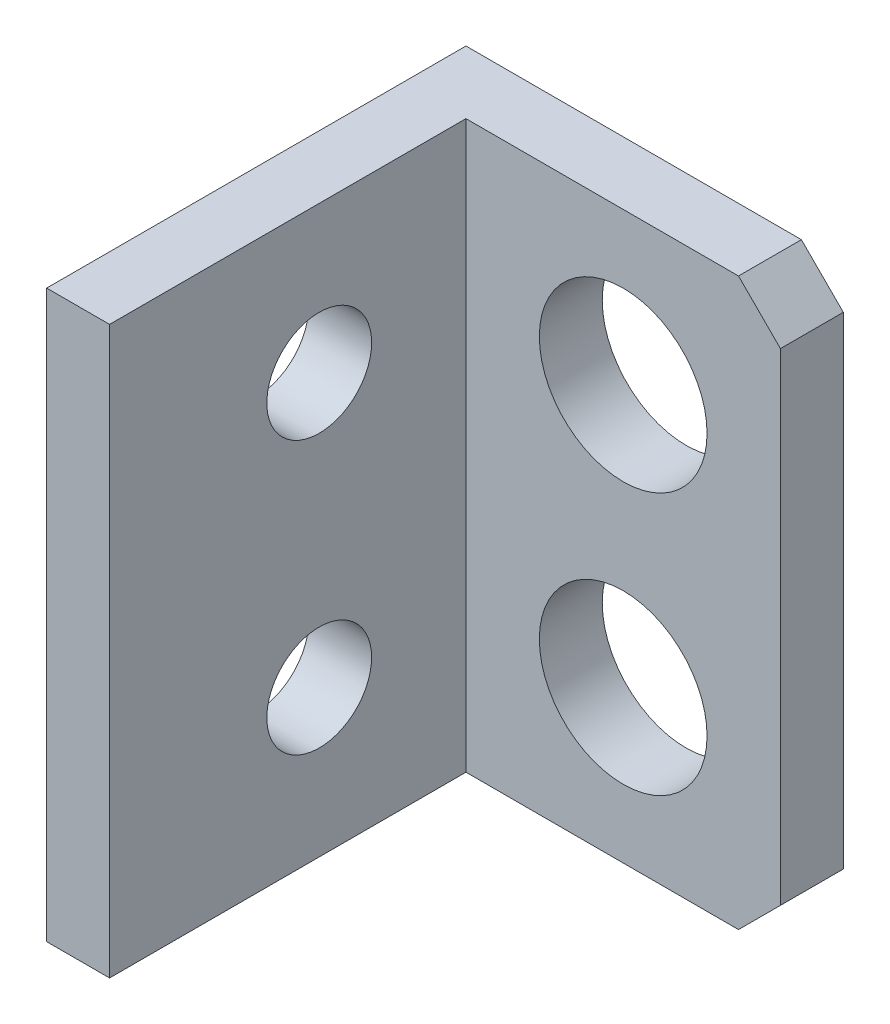
ISO-10303-21;
HEADER;
FILE_DESCRIPTION(('STEP AP214'),'2;1');
FILE_NAME('part.step','',(''),(''),'','','');
FILE_SCHEMA(('AUTOMOTIVE_DESIGN { 1 0 10303 214 1 1 1 1 }'));
ENDSEC;
DATA;
#1=APPLICATION_CONTEXT('core data for automotive mechanical design processes');
#2=APPLICATION_PROTOCOL_DEFINITION('international standard','automotive_design',2000,#1);
#3=PRODUCT_CONTEXT('',#1,'mechanical');
#4=PRODUCT('Part','Part','',(#3));
#5=PRODUCT_RELATED_PRODUCT_CATEGORY('part','',(#4));
#6=PRODUCT_DEFINITION_FORMATION('','',#4);
#7=PRODUCT_DEFINITION_CONTEXT('part definition',#1,'design');
#8=PRODUCT_DEFINITION('design','',#6,#7);
#9=PRODUCT_DEFINITION_SHAPE('','',#8);
#10=(LENGTH_UNIT() NAMED_UNIT(*) SI_UNIT(.MILLI.,.METRE.));
#11=(NAMED_UNIT(*) PLANE_ANGLE_UNIT() SI_UNIT($,.RADIAN.));
#12=(NAMED_UNIT(*) SI_UNIT($,.STERADIAN.) SOLID_ANGLE_UNIT());
#13=UNCERTAINTY_MEASURE_WITH_UNIT(LENGTH_MEASURE(1.E-05),#10,'distance_accuracy_value','');
#14=(GEOMETRIC_REPRESENTATION_CONTEXT(3) GLOBAL_UNCERTAINTY_ASSIGNED_CONTEXT((#13)) GLOBAL_UNIT_ASSIGNED_CONTEXT((#10,
#11,#12)) REPRESENTATION_CONTEXT('',''));
#15=CARTESIAN_POINT('',(0.,0.,0.));
#16=DIRECTION('',(0.,0.,1.));
#17=DIRECTION('',(1.,0.,0.));
#18=AXIS2_PLACEMENT_3D('',#15,#16,#17);
#19=CARTESIAN_POINT('',(3.,0.,0.));
#20=DIRECTION('',(-1.,0.,0.));
#21=DIRECTION('',(0.,0.,1.));
#22=AXIS2_PLACEMENT_3D('',#19,#20,#21);
#23=PLANE('',#22);
#24=CARTESIAN_POINT('',(3.,20.,-10.));
#25=DIRECTION('',(1.,0.,0.));
#26=DIRECTION('',(0.,0.,-1.));
#27=AXIS2_PLACEMENT_3D('',#24,#25,#26);
#28=CIRCLE('',#27,2.5);
#29=CARTESIAN_POINT('',(3.,20.,-12.5));
#30=VERTEX_POINT('',#29);
#31=EDGE_CURVE('E141',#30,#30,#28,.T.);
#32=ORIENTED_EDGE('',*,*,#31,.F.);
#33=EDGE_LOOP('',(#32));
#34=FACE_BOUND('',#33,.T.);
#35=CARTESIAN_POINT('',(3.,7.,-10.));
#36=DIRECTION('',(1.,0.,0.));
#37=DIRECTION('',(0.,0.,-1.));
#38=AXIS2_PLACEMENT_3D('',#35,#36,#37);
#39=CIRCLE('',#38,2.5);
#40=CARTESIAN_POINT('',(3.,7.,-12.5));
#41=VERTEX_POINT('',#40);
#42=EDGE_CURVE('E149',#41,#41,#39,.T.);
#43=ORIENTED_EDGE('',*,*,#42,.F.);
#44=EDGE_LOOP('',(#43));
#45=FACE_BOUND('',#44,.T.);
#46=DIRECTION('',(0.,-1.,0.));
#47=VECTOR('',#46,1.);
#48=CARTESIAN_POINT('',(3.,27.,-17.));
#49=LINE('',#48,#47);
#50=CARTESIAN_POINT('',(3.,27.,-17.));
#51=VERTEX_POINT('',#50);
#52=CARTESIAN_POINT('',(3.,0.,-17.));
#53=VERTEX_POINT('',#52);
#54=EDGE_CURVE('E116',#51,#53,#49,.T.);
#55=ORIENTED_EDGE('',*,*,#54,.F.);
#56=DIRECTION('',(0.,0.,1.));
#57=VECTOR('',#56,1.);
#58=CARTESIAN_POINT('',(3.,27.,0.));
#59=LINE('',#58,#57);
#60=CARTESIAN_POINT('',(3.,27.,0.));
#61=VERTEX_POINT('',#60);
#62=EDGE_CURVE('E122',#51,#61,#59,.T.);
#63=ORIENTED_EDGE('',*,*,#62,.T.);
#64=DIRECTION('',(0.,-1.,0.));
#65=VECTOR('',#64,1.);
#66=CARTESIAN_POINT('',(3.,0.,0.));
#67=LINE('',#66,#65);
#68=CARTESIAN_POINT('',(3.,0.,0.));
#69=VERTEX_POINT('',#68);
#70=EDGE_CURVE('E119',#61,#69,#67,.T.);
#71=ORIENTED_EDGE('',*,*,#70,.T.);
#72=DIRECTION('',(0.,0.,-1.));
#73=VECTOR('',#72,1.);
#74=CARTESIAN_POINT('',(3.,0.,0.));
#75=LINE('',#74,#73);
#76=EDGE_CURVE('E106',#69,#53,#75,.T.);
#77=ORIENTED_EDGE('',*,*,#76,.T.);
#78=EDGE_LOOP('',(#55,#63,#71,#77));
#79=FACE_BOUND('',#78,.T.);
#80=ADVANCED_FACE('F39',(#34,#45,#79),#23,.F.);
#81=CARTESIAN_POINT('',(0.,0.,0.));
#82=DIRECTION('',(-1.,0.,0.));
#83=DIRECTION('',(0.,0.,1.));
#84=AXIS2_PLACEMENT_3D('',#81,#82,#83);
#85=PLANE('',#84);
#86=CARTESIAN_POINT('',(0.,7.,-10.));
#87=DIRECTION('',(1.,0.,0.));
#88=DIRECTION('',(0.,0.,-1.));
#89=AXIS2_PLACEMENT_3D('',#86,#87,#88);
#90=CIRCLE('',#89,2.5);
#91=CARTESIAN_POINT('',(0.,7.,-12.5));
#92=VERTEX_POINT('',#91);
#93=EDGE_CURVE('E145',#92,#92,#90,.T.);
#94=ORIENTED_EDGE('',*,*,#93,.T.);
#95=EDGE_LOOP('',(#94));
#96=FACE_BOUND('',#95,.T.);
#97=DIRECTION('',(0.,-1.,0.));
#98=VECTOR('',#97,1.);
#99=CARTESIAN_POINT('',(0.,0.,0.));
#100=LINE('',#99,#98);
#101=CARTESIAN_POINT('',(0.,27.,0.));
#102=VERTEX_POINT('',#101);
#103=CARTESIAN_POINT('',(0.,0.,0.));
#104=VERTEX_POINT('',#103);
#105=EDGE_CURVE('E153',#102,#104,#100,.T.);
#106=ORIENTED_EDGE('',*,*,#105,.F.);
#107=DIRECTION('',(0.,0.,1.));
#108=VECTOR('',#107,1.);
#109=CARTESIAN_POINT('',(0.,27.,0.));
#110=LINE('',#109,#108);
#111=CARTESIAN_POINT('',(0.,27.,-20.));
#112=VERTEX_POINT('',#111);
#113=EDGE_CURVE('E158',#112,#102,#110,.T.);
#114=ORIENTED_EDGE('',*,*,#113,.F.);
#115=DIRECTION('',(0.,1.,0.));
#116=VECTOR('',#115,1.);
#117=CARTESIAN_POINT('',(0.,0.,-20.));
#118=LINE('',#117,#116);
#119=CARTESIAN_POINT('',(0.,0.,-20.));
#120=VERTEX_POINT('',#119);
#121=EDGE_CURVE('E170',#120,#112,#118,.T.);
#122=ORIENTED_EDGE('',*,*,#121,.F.);
#123=DIRECTION('',(0.,0.,-1.));
#124=VECTOR('',#123,1.);
#125=CARTESIAN_POINT('',(0.,0.,0.));
#126=LINE('',#125,#124);
#127=EDGE_CURVE('E166',#104,#120,#126,.T.);
#128=ORIENTED_EDGE('',*,*,#127,.F.);
#129=EDGE_LOOP('',(#106,#114,#122,#128));
#130=FACE_BOUND('',#129,.T.);
#131=CARTESIAN_POINT('',(0.,20.,-10.));
#132=DIRECTION('',(1.,0.,0.));
#133=DIRECTION('',(0.,0.,-1.));
#134=AXIS2_PLACEMENT_3D('',#131,#132,#133);
#135=CIRCLE('',#134,2.5);
#136=CARTESIAN_POINT('',(0.,20.,-12.5));
#137=VERTEX_POINT('',#136);
#138=EDGE_CURVE('E140',#137,#137,#135,.T.);
#139=ORIENTED_EDGE('',*,*,#138,.T.);
#140=EDGE_LOOP('',(#139));
#141=FACE_BOUND('',#140,.T.);
#142=ADVANCED_FACE('F225',(#96,#130,#141),#85,.T.);
#143=CARTESIAN_POINT('',(3.,0.,0.));
#144=DIRECTION('',(0.,0.,-1.));
#145=DIRECTION('',(-1.,0.,0.));
#146=AXIS2_PLACEMENT_3D('',#143,#144,#145);
#147=PLANE('',#146);
#148=ORIENTED_EDGE('',*,*,#105,.T.);
#149=DIRECTION('',(-1.,0.,0.));
#150=VECTOR('',#149,1.);
#151=CARTESIAN_POINT('',(3.,0.,0.));
#152=LINE('',#151,#150);
#153=EDGE_CURVE('E185',#69,#104,#152,.T.);
#154=ORIENTED_EDGE('',*,*,#153,.F.);
#155=ORIENTED_EDGE('',*,*,#70,.F.);
#156=DIRECTION('',(-1.,0.,0.));
#157=VECTOR('',#156,1.);
#158=CARTESIAN_POINT('',(3.,27.,0.));
#159=LINE('',#158,#157);
#160=EDGE_CURVE('E162',#61,#102,#159,.T.);
#161=ORIENTED_EDGE('',*,*,#160,.T.);
#162=EDGE_LOOP('',(#148,#154,#155,#161));
#163=FACE_BOUND('',#162,.T.);
#164=ADVANCED_FACE('F235',(#163),#147,.F.);
#165=CARTESIAN_POINT('',(3.,0.,0.));
#166=DIRECTION('',(0.,1.,0.));
#167=DIRECTION('',(0.,0.,1.));
#168=AXIS2_PLACEMENT_3D('',#165,#166,#167);
#169=PLANE('',#168);
#170=DIRECTION('',(-1.,0.,0.));
#171=VECTOR('',#170,1.);
#172=CARTESIAN_POINT('',(3.,0.,-20.));
#173=LINE('',#172,#171);
#174=CARTESIAN_POINT('',(16.,0.,-20.));
#175=VERTEX_POINT('',#174);
#176=EDGE_CURVE('E182',#175,#120,#173,.T.);
#177=ORIENTED_EDGE('',*,*,#176,.F.);
#178=DIRECTION('',(0.,0.,1.));
#179=VECTOR('',#178,1.);
#180=CARTESIAN_POINT('',(16.,0.,0.));
#181=LINE('',#180,#179);
#182=CARTESIAN_POINT('',(16.,0.,-17.));
#183=VERTEX_POINT('',#182);
#184=EDGE_CURVE('E63',#175,#183,#181,.T.);
#185=ORIENTED_EDGE('',*,*,#184,.T.);
#186=DIRECTION('',(-1.,0.,0.));
#187=VECTOR('',#186,1.);
#188=CARTESIAN_POINT('',(18.,0.,-17.));
#189=LINE('',#188,#187);
#190=EDGE_CURVE('E102',#183,#53,#189,.T.);
#191=ORIENTED_EDGE('',*,*,#190,.T.);
#192=ORIENTED_EDGE('',*,*,#76,.F.);
#193=ORIENTED_EDGE('',*,*,#153,.T.);
#194=ORIENTED_EDGE('',*,*,#127,.T.);
#195=EDGE_LOOP('',(#177,#185,#191,#192,#193,#194));
#196=FACE_BOUND('',#195,.T.);
#197=ADVANCED_FACE('F104',(#196),#169,.F.);
#198=CARTESIAN_POINT('',(3.,0.,-20.));
#199=DIRECTION('',(0.,0.,1.));
#200=DIRECTION('',(1.,0.,0.));
#201=AXIS2_PLACEMENT_3D('',#198,#199,#200);
#202=PLANE('',#201);
#203=CARTESIAN_POINT('',(10.5,19.75,-20.));
#204=DIRECTION('',(0.,0.,-1.));
#205=DIRECTION('',(-1.,0.,0.));
#206=AXIS2_PLACEMENT_3D('',#203,#204,#205);
#207=CIRCLE('',#206,4.);
#208=CARTESIAN_POINT('',(6.5,19.75,-20.));
#209=VERTEX_POINT('',#208);
#210=EDGE_CURVE('E191',#209,#209,#207,.T.);
#211=ORIENTED_EDGE('',*,*,#210,.F.);
#212=EDGE_LOOP('',(#211));
#213=FACE_BOUND('',#212,.T.);
#214=CARTESIAN_POINT('',(10.5,7.25,-20.));
#215=DIRECTION('',(0.,0.,-1.));
#216=DIRECTION('',(-1.,0.,0.));
#217=AXIS2_PLACEMENT_3D('',#214,#215,#216);
#218=CIRCLE('',#217,4.);
#219=CARTESIAN_POINT('',(6.5,7.25,-20.));
#220=VERTEX_POINT('',#219);
#221=EDGE_CURVE('E267',#220,#220,#218,.T.);
#222=ORIENTED_EDGE('',*,*,#221,.F.);
#223=EDGE_LOOP('',(#222));
#224=FACE_BOUND('',#223,.T.);
#225=DIRECTION('',(0.,1.,0.));
#226=VECTOR('',#225,1.);
#227=CARTESIAN_POINT('',(18.,27.,-20.));
#228=LINE('',#227,#226);
#229=CARTESIAN_POINT('',(18.,2.,-20.));
#230=VERTEX_POINT('',#229);
#231=CARTESIAN_POINT('',(18.,25.,-20.));
#232=VERTEX_POINT('',#231);
#233=EDGE_CURVE('E126',#230,#232,#228,.T.);
#234=ORIENTED_EDGE('',*,*,#233,.F.);
#235=DIRECTION('',(0.707106781186549,0.707106781186546,0.));
#236=VECTOR('',#235,1.);
#237=CARTESIAN_POINT('',(18.,2.,-20.));
#238=LINE('',#237,#236);
#239=EDGE_CURVE('E203',#230,#175,#238,.F.);
#240=ORIENTED_EDGE('',*,*,#239,.T.);
#241=ORIENTED_EDGE('',*,*,#176,.T.);
#242=ORIENTED_EDGE('',*,*,#121,.T.);
#243=DIRECTION('',(-1.,0.,0.));
#244=VECTOR('',#243,1.);
#245=CARTESIAN_POINT('',(3.,27.,-20.));
#246=LINE('',#245,#244);
#247=CARTESIAN_POINT('',(16.,27.,-20.));
#248=VERTEX_POINT('',#247);
#249=EDGE_CURVE('E179',#248,#112,#246,.T.);
#250=ORIENTED_EDGE('',*,*,#249,.F.);
#251=DIRECTION('',(-0.707106781186549,0.707106781186546,0.));
#252=VECTOR('',#251,1.);
#253=CARTESIAN_POINT('',(18.,25.,-20.));
#254=LINE('',#253,#252);
#255=EDGE_CURVE('E200',#248,#232,#254,.F.);
#256=ORIENTED_EDGE('',*,*,#255,.T.);
#257=EDGE_LOOP('',(#234,#240,#241,#242,#250,#256));
#258=FACE_BOUND('',#257,.T.);
#259=ADVANCED_FACE('F220',(#213,#224,#258),#202,.F.);
#260=CARTESIAN_POINT('',(3.,27.,0.));
#261=DIRECTION('',(0.,-1.,0.));
#262=DIRECTION('',(0.,0.,-1.));
#263=AXIS2_PLACEMENT_3D('',#260,#261,#262);
#264=PLANE('',#263);
#265=DIRECTION('',(-1.,0.,0.));
#266=VECTOR('',#265,1.);
#267=CARTESIAN_POINT('',(18.,27.,-17.));
#268=LINE('',#267,#266);
#269=CARTESIAN_POINT('',(16.,27.,-17.));
#270=VERTEX_POINT('',#269);
#271=EDGE_CURVE('E111',#270,#51,#268,.T.);
#272=ORIENTED_EDGE('',*,*,#271,.F.);
#273=DIRECTION('',(0.,0.,-1.));
#274=VECTOR('',#273,1.);
#275=CARTESIAN_POINT('',(16.,27.,0.));
#276=LINE('',#275,#274);
#277=EDGE_CURVE('E11',#270,#248,#276,.T.);
#278=ORIENTED_EDGE('',*,*,#277,.T.);
#279=ORIENTED_EDGE('',*,*,#249,.T.);
#280=ORIENTED_EDGE('',*,*,#113,.T.);
#281=ORIENTED_EDGE('',*,*,#160,.F.);
#282=ORIENTED_EDGE('',*,*,#62,.F.);
#283=EDGE_LOOP('',(#272,#278,#279,#280,#281,#282));
#284=FACE_BOUND('',#283,.T.);
#285=ADVANCED_FACE('F232',(#284),#264,.F.);
#286=CARTESIAN_POINT('',(3.,7.,-10.));
#287=DIRECTION('',(-1.,0.,0.));
#288=DIRECTION('',(0.,0.,1.));
#289=AXIS2_PLACEMENT_3D('',#286,#287,#288);
#290=CYLINDRICAL_SURFACE('',#289,2.5);
#291=ORIENTED_EDGE('',*,*,#42,.T.);
#292=EDGE_LOOP('',(#291));
#293=FACE_BOUND('',#292,.T.);
#294=ORIENTED_EDGE('',*,*,#93,.F.);
#295=EDGE_LOOP('',(#294));
#296=FACE_BOUND('',#295,.T.);
#297=ADVANCED_FACE('F253',(#293,#296),#290,.F.);
#298=CARTESIAN_POINT('',(3.,20.,-10.));
#299=DIRECTION('',(-1.,0.,0.));
#300=DIRECTION('',(0.,0.,1.));
#301=AXIS2_PLACEMENT_3D('',#298,#299,#300);
#302=CYLINDRICAL_SURFACE('',#301,2.5);
#303=ORIENTED_EDGE('',*,*,#31,.T.);
#304=EDGE_LOOP('',(#303));
#305=FACE_BOUND('',#304,.T.);
#306=ORIENTED_EDGE('',*,*,#138,.F.);
#307=EDGE_LOOP('',(#306));
#308=FACE_BOUND('',#307,.T.);
#309=ADVANCED_FACE('F283',(#305,#308),#302,.F.);
#310=CARTESIAN_POINT('',(18.,27.,-17.));
#311=DIRECTION('',(0.,0.,-1.));
#312=DIRECTION('',(0.,1.,0.));
#313=AXIS2_PLACEMENT_3D('',#310,#311,#312);
#314=PLANE('',#313);
#315=CARTESIAN_POINT('',(10.5,19.75,-17.));
#316=DIRECTION('',(0.,0.,-1.));
#317=DIRECTION('',(0.,1.,0.));
#318=AXIS2_PLACEMENT_3D('',#315,#316,#317);
#319=CIRCLE('',#318,4.);
#320=CARTESIAN_POINT('',(10.5,23.75,-17.));
#321=VERTEX_POINT('',#320);
#322=EDGE_CURVE('E127',#321,#321,#319,.T.);
#323=ORIENTED_EDGE('',*,*,#322,.T.);
#324=EDGE_LOOP('',(#323));
#325=FACE_BOUND('',#324,.T.);
#326=CARTESIAN_POINT('',(10.5,7.25,-17.));
#327=DIRECTION('',(0.,0.,-1.));
#328=DIRECTION('',(0.,1.,0.));
#329=AXIS2_PLACEMENT_3D('',#326,#327,#328);
#330=CIRCLE('',#329,4.);
#331=CARTESIAN_POINT('',(10.5,11.25,-17.));
#332=VERTEX_POINT('',#331);
#333=EDGE_CURVE('E134',#332,#332,#330,.T.);
#334=ORIENTED_EDGE('',*,*,#333,.T.);
#335=EDGE_LOOP('',(#334));
#336=FACE_BOUND('',#335,.T.);
#337=ORIENTED_EDGE('',*,*,#190,.F.);
#338=DIRECTION('',(-0.707106781186549,-0.707106781186546,0.));
#339=VECTOR('',#338,1.);
#340=CARTESIAN_POINT('',(18.,2.,-17.));
#341=LINE('',#340,#339);
#342=CARTESIAN_POINT('',(18.,2.,-17.));
#343=VERTEX_POINT('',#342);
#344=EDGE_CURVE('E48',#183,#343,#341,.F.);
#345=ORIENTED_EDGE('',*,*,#344,.T.);
#346=DIRECTION('',(0.,-1.,0.));
#347=VECTOR('',#346,1.);
#348=CARTESIAN_POINT('',(18.,27.,-17.));
#349=LINE('',#348,#347);
#350=CARTESIAN_POINT('',(18.,25.,-17.));
#351=VERTEX_POINT('',#350);
#352=EDGE_CURVE('E112',#351,#343,#349,.T.);
#353=ORIENTED_EDGE('',*,*,#352,.F.);
#354=DIRECTION('',(0.707106781186549,-0.707106781186546,0.));
#355=VECTOR('',#354,1.);
#356=CARTESIAN_POINT('',(18.,25.,-17.));
#357=LINE('',#356,#355);
#358=EDGE_CURVE('E55',#351,#270,#357,.F.);
#359=ORIENTED_EDGE('',*,*,#358,.T.);
#360=ORIENTED_EDGE('',*,*,#271,.T.);
#361=ORIENTED_EDGE('',*,*,#54,.T.);
#362=EDGE_LOOP('',(#337,#345,#353,#359,#360,#361));
#363=FACE_BOUND('',#362,.T.);
#364=ADVANCED_FACE('F124',(#325,#336,#363),#314,.F.);
#365=CARTESIAN_POINT('',(18.,0.,0.));
#366=DIRECTION('',(-1.,0.,0.));
#367=DIRECTION('',(0.,0.,1.));
#368=AXIS2_PLACEMENT_3D('',#365,#366,#367);
#369=PLANE('',#368);
#370=ORIENTED_EDGE('',*,*,#352,.T.);
#371=DIRECTION('',(0.,0.,-1.));
#372=VECTOR('',#371,1.);
#373=CARTESIAN_POINT('',(18.,2.,0.));
#374=LINE('',#373,#372);
#375=EDGE_CURVE('E196',#343,#230,#374,.T.);
#376=ORIENTED_EDGE('',*,*,#375,.T.);
#377=ORIENTED_EDGE('',*,*,#233,.T.);
#378=DIRECTION('',(0.,0.,1.));
#379=VECTOR('',#378,1.);
#380=CARTESIAN_POINT('',(18.,25.,0.));
#381=LINE('',#380,#379);
#382=EDGE_CURVE('E188',#232,#351,#381,.T.);
#383=ORIENTED_EDGE('',*,*,#382,.T.);
#384=EDGE_LOOP('',(#370,#376,#377,#383));
#385=FACE_BOUND('',#384,.T.);
#386=ADVANCED_FACE('F214',(#385),#369,.F.);
#387=CARTESIAN_POINT('',(10.5,7.25,-5.));
#388=DIRECTION('',(0.,0.,-1.));
#389=DIRECTION('',(-1.,0.,0.));
#390=AXIS2_PLACEMENT_3D('',#387,#388,#389);
#391=CYLINDRICAL_SURFACE('',#390,4.);
#392=ORIENTED_EDGE('',*,*,#221,.T.);
#393=EDGE_LOOP('',(#392));
#394=FACE_BOUND('',#393,.T.);
#395=ORIENTED_EDGE('',*,*,#333,.F.);
#396=EDGE_LOOP('',(#395));
#397=FACE_BOUND('',#396,.T.);
#398=ADVANCED_FACE('F277',(#394,#397),#391,.F.);
#399=CARTESIAN_POINT('',(10.5,19.75,-5.));
#400=DIRECTION('',(0.,0.,-1.));
#401=DIRECTION('',(-1.,0.,0.));
#402=AXIS2_PLACEMENT_3D('',#399,#400,#401);
#403=CYLINDRICAL_SURFACE('',#402,4.);
#404=ORIENTED_EDGE('',*,*,#210,.T.);
#405=EDGE_LOOP('',(#404));
#406=FACE_BOUND('',#405,.T.);
#407=ORIENTED_EDGE('',*,*,#322,.F.);
#408=EDGE_LOOP('',(#407));
#409=FACE_BOUND('',#408,.T.);
#410=ADVANCED_FACE('F274',(#406,#409),#403,.F.);
#411=CARTESIAN_POINT('',(18.,2.,0.));
#412=DIRECTION('',(-0.707106781186546,0.707106781186549,0.));
#413=DIRECTION('',(0.,0.,-1.));
#414=AXIS2_PLACEMENT_3D('',#411,#412,#413);
#415=PLANE('',#414);
#416=ORIENTED_EDGE('',*,*,#344,.F.);
#417=ORIENTED_EDGE('',*,*,#184,.F.);
#418=ORIENTED_EDGE('',*,*,#239,.F.);
#419=ORIENTED_EDGE('',*,*,#375,.F.);
#420=EDGE_LOOP('',(#416,#417,#418,#419));
#421=FACE_BOUND('',#420,.T.);
#422=ADVANCED_FACE('F218',(#421),#415,.F.);
#423=CARTESIAN_POINT('',(18.,25.,0.));
#424=DIRECTION('',(-0.707106781186546,-0.707106781186549,0.));
#425=DIRECTION('',(0.,0.,1.));
#426=AXIS2_PLACEMENT_3D('',#423,#424,#425);
#427=PLANE('',#426);
#428=ORIENTED_EDGE('',*,*,#255,.F.);
#429=ORIENTED_EDGE('',*,*,#277,.F.);
#430=ORIENTED_EDGE('',*,*,#358,.F.);
#431=ORIENTED_EDGE('',*,*,#382,.F.);
#432=EDGE_LOOP('',(#428,#429,#430,#431));
#433=FACE_BOUND('',#432,.T.);
#434=ADVANCED_FACE('F41',(#433),#427,.F.);
#435=CLOSED_SHELL('',(#80,#142,#164,#197,#259,#285,#297,#309,#364,#386,#398,#410,#422,#434));
#436=MANIFOLD_SOLID_BREP('B2',#435);
#437=ADVANCED_BREP_SHAPE_REPRESENTATION('',(#18,#436),#14);
#438=SHAPE_DEFINITION_REPRESENTATION(#9,#437);
ENDSEC;
END-ISO-10303-21;
